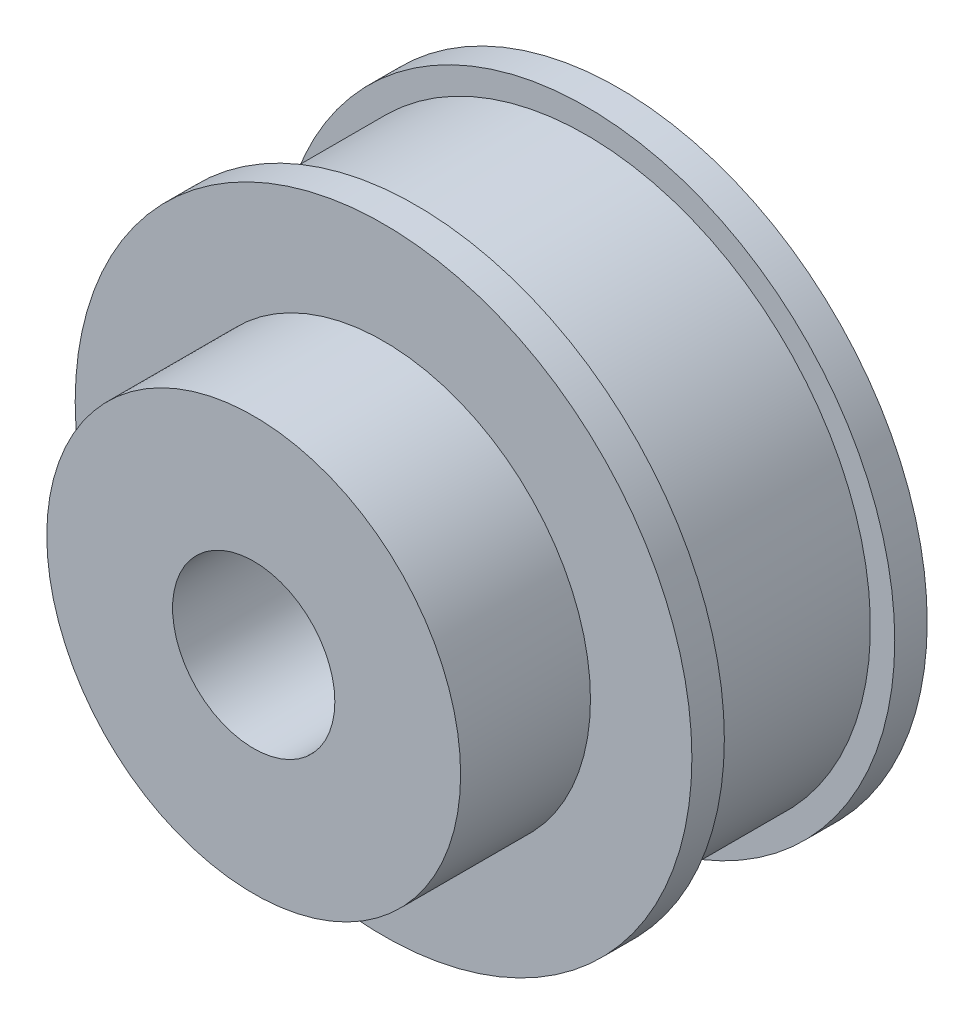
ISO-10303-21;
HEADER;
FILE_DESCRIPTION(('STEP AP214'),'2;1');
FILE_NAME('part.step','',(''),(''),'','','');
FILE_SCHEMA(('AUTOMOTIVE_DESIGN { 1 0 10303 214 1 1 1 1 }'));
ENDSEC;
DATA;
#1=APPLICATION_CONTEXT('core data for automotive mechanical design processes');
#2=APPLICATION_PROTOCOL_DEFINITION('international standard','automotive_design',2000,#1);
#3=PRODUCT_CONTEXT('',#1,'mechanical');
#4=PRODUCT('Part','Part','',(#3));
#5=PRODUCT_RELATED_PRODUCT_CATEGORY('part','',(#4));
#6=PRODUCT_DEFINITION_FORMATION('','',#4);
#7=PRODUCT_DEFINITION_CONTEXT('part definition',#1,'design');
#8=PRODUCT_DEFINITION('design','',#6,#7);
#9=PRODUCT_DEFINITION_SHAPE('','',#8);
#10=(LENGTH_UNIT() NAMED_UNIT(*) SI_UNIT(.MILLI.,.METRE.));
#11=(NAMED_UNIT(*) PLANE_ANGLE_UNIT() SI_UNIT($,.RADIAN.));
#12=(NAMED_UNIT(*) SI_UNIT($,.STERADIAN.) SOLID_ANGLE_UNIT());
#13=UNCERTAINTY_MEASURE_WITH_UNIT(LENGTH_MEASURE(1.E-05),#10,'distance_accuracy_value','');
#14=(GEOMETRIC_REPRESENTATION_CONTEXT(3) GLOBAL_UNCERTAINTY_ASSIGNED_CONTEXT((#13)) GLOBAL_UNIT_ASSIGNED_CONTEXT((#10,
#11,#12)) REPRESENTATION_CONTEXT('',''));
#15=CARTESIAN_POINT('',(0.,0.,0.));
#16=DIRECTION('',(0.,0.,1.));
#17=DIRECTION('',(1.,0.,0.));
#18=AXIS2_PLACEMENT_3D('',#15,#16,#17);
#19=CARTESIAN_POINT('',(0.,0.,14.5));
#20=DIRECTION('',(0.,0.,-1.));
#21=DIRECTION('',(-1.,0.,0.));
#22=AXIS2_PLACEMENT_3D('',#19,#20,#21);
#23=CYLINDRICAL_SURFACE('',#22,17.5);
#24=CARTESIAN_POINT('',(0.,0.,12.5));
#25=DIRECTION('',(0.,0.,-1.));
#26=DIRECTION('',(-1.,0.,0.));
#27=AXIS2_PLACEMENT_3D('',#24,#25,#26);
#28=CIRCLE('',#27,17.5);
#29=CARTESIAN_POINT('',(-17.5,0.,12.5));
#30=VERTEX_POINT('',#29);
#31=EDGE_CURVE('E63',#30,#30,#28,.T.);
#32=ORIENTED_EDGE('',*,*,#31,.T.);
#33=EDGE_LOOP('',(#32));
#34=FACE_BOUND('',#33,.T.);
#35=CARTESIAN_POINT('',(0.,0.,2.));
#36=DIRECTION('',(0.,0.,-1.));
#37=DIRECTION('',(-1.,0.,0.));
#38=AXIS2_PLACEMENT_3D('',#35,#36,#37);
#39=CIRCLE('',#38,17.5);
#40=CARTESIAN_POINT('',(-17.5,0.,2.));
#41=VERTEX_POINT('',#40);
#42=EDGE_CURVE('E10',#41,#41,#39,.T.);
#43=ORIENTED_EDGE('',*,*,#42,.F.);
#44=EDGE_LOOP('',(#43));
#45=FACE_BOUND('',#44,.T.);
#46=ADVANCED_FACE('F31',(#34,#45),#23,.T.);
#47=CARTESIAN_POINT('',(0.,0.,14.5));
#48=DIRECTION('',(0.,0.,1.));
#49=DIRECTION('',(1.,0.,0.));
#50=AXIS2_PLACEMENT_3D('',#47,#48,#49);
#51=PLANE('',#50);
#52=CARTESIAN_POINT('',(0.,0.,14.5));
#53=DIRECTION('',(0.,0.,1.));
#54=DIRECTION('',(1.,0.,0.));
#55=AXIS2_PLACEMENT_3D('',#52,#53,#54);
#56=CIRCLE('',#55,12.75);
#57=CARTESIAN_POINT('',(12.75,0.,14.5));
#58=VERTEX_POINT('',#57);
#59=EDGE_CURVE('E45',#58,#58,#56,.T.);
#60=ORIENTED_EDGE('',*,*,#59,.F.);
#61=EDGE_LOOP('',(#60));
#62=FACE_BOUND('',#61,.T.);
#63=CARTESIAN_POINT('',(0.,0.,14.5));
#64=DIRECTION('',(0.,0.,-1.));
#65=DIRECTION('',(-1.,0.,0.));
#66=AXIS2_PLACEMENT_3D('',#63,#64,#65);
#67=CIRCLE('',#66,19.);
#68=CARTESIAN_POINT('',(-19.,0.,14.5));
#69=VERTEX_POINT('',#68);
#70=EDGE_CURVE('E60',#69,#69,#67,.T.);
#71=ORIENTED_EDGE('',*,*,#70,.F.);
#72=EDGE_LOOP('',(#71));
#73=FACE_BOUND('',#72,.T.);
#74=ADVANCED_FACE('F86',(#62,#73),#51,.T.);
#75=CARTESIAN_POINT('',(0.,0.,0.));
#76=DIRECTION('',(0.,0.,1.));
#77=DIRECTION('',(1.,0.,0.));
#78=AXIS2_PLACEMENT_3D('',#75,#76,#77);
#79=PLANE('',#78);
#80=CARTESIAN_POINT('',(0.,0.,0.));
#81=DIRECTION('',(0.,0.,1.));
#82=DIRECTION('',(1.,0.,0.));
#83=AXIS2_PLACEMENT_3D('',#80,#81,#82);
#84=CIRCLE('',#83,5.);
#85=CARTESIAN_POINT('',(5.,0.,0.));
#86=VERTEX_POINT('',#85);
#87=EDGE_CURVE('E37',#86,#86,#84,.T.);
#88=ORIENTED_EDGE('',*,*,#87,.T.);
#89=EDGE_LOOP('',(#88));
#90=FACE_BOUND('',#89,.T.);
#91=CARTESIAN_POINT('',(0.,0.,0.));
#92=DIRECTION('',(0.,0.,-1.));
#93=DIRECTION('',(-1.,0.,0.));
#94=AXIS2_PLACEMENT_3D('',#91,#92,#93);
#95=CIRCLE('',#94,19.);
#96=CARTESIAN_POINT('',(-19.,0.,0.));
#97=VERTEX_POINT('',#96);
#98=EDGE_CURVE('E54',#97,#97,#95,.T.);
#99=ORIENTED_EDGE('',*,*,#98,.T.);
#100=EDGE_LOOP('',(#99));
#101=FACE_BOUND('',#100,.T.);
#102=ADVANCED_FACE('F90',(#90,#101),#79,.F.);
#103=CARTESIAN_POINT('',(0.,0.,14.5));
#104=DIRECTION('',(0.,0.,-1.));
#105=DIRECTION('',(-1.,0.,0.));
#106=AXIS2_PLACEMENT_3D('',#103,#104,#105);
#107=CYLINDRICAL_SURFACE('',#106,5.);
#108=ORIENTED_EDGE('',*,*,#87,.F.);
#109=EDGE_LOOP('',(#108));
#110=FACE_BOUND('',#109,.T.);
#111=CARTESIAN_POINT('',(0.,0.,22.5));
#112=DIRECTION('',(0.,0.,1.));
#113=DIRECTION('',(1.,0.,0.));
#114=AXIS2_PLACEMENT_3D('',#111,#112,#113);
#115=CIRCLE('',#114,5.);
#116=CARTESIAN_POINT('',(5.,0.,22.5));
#117=VERTEX_POINT('',#116);
#118=EDGE_CURVE('E49',#117,#117,#115,.T.);
#119=ORIENTED_EDGE('',*,*,#118,.T.);
#120=EDGE_LOOP('',(#119));
#121=FACE_BOUND('',#120,.T.);
#122=ADVANCED_FACE('F96',(#110,#121),#107,.F.);
#123=CARTESIAN_POINT('',(0.,0.,22.5));
#124=DIRECTION('',(0.,0.,1.));
#125=DIRECTION('',(1.,0.,0.));
#126=AXIS2_PLACEMENT_3D('',#123,#124,#125);
#127=PLANE('',#126);
#128=CARTESIAN_POINT('',(0.,0.,22.5));
#129=DIRECTION('',(0.,0.,1.));
#130=DIRECTION('',(1.,0.,0.));
#131=AXIS2_PLACEMENT_3D('',#128,#129,#130);
#132=CIRCLE('',#131,12.75);
#133=CARTESIAN_POINT('',(12.75,0.,22.5));
#134=VERTEX_POINT('',#133);
#135=EDGE_CURVE('E41',#134,#134,#132,.T.);
#136=ORIENTED_EDGE('',*,*,#135,.T.);
#137=EDGE_LOOP('',(#136));
#138=FACE_BOUND('',#137,.T.);
#139=ORIENTED_EDGE('',*,*,#118,.F.);
#140=EDGE_LOOP('',(#139));
#141=FACE_BOUND('',#140,.T.);
#142=ADVANCED_FACE('F102',(#138,#141),#127,.T.);
#143=CARTESIAN_POINT('',(0.,0.,22.5));
#144=DIRECTION('',(0.,0.,-1.));
#145=DIRECTION('',(-1.,0.,0.));
#146=AXIS2_PLACEMENT_3D('',#143,#144,#145);
#147=CYLINDRICAL_SURFACE('',#146,12.75);
#148=ORIENTED_EDGE('',*,*,#135,.F.);
#149=EDGE_LOOP('',(#148));
#150=FACE_BOUND('',#149,.T.);
#151=ORIENTED_EDGE('',*,*,#59,.T.);
#152=EDGE_LOOP('',(#151));
#153=FACE_BOUND('',#152,.T.);
#154=ADVANCED_FACE('F104',(#150,#153),#147,.T.);
#155=CARTESIAN_POINT('',(0.,0.,2.));
#156=DIRECTION('',(0.,0.,-1.));
#157=DIRECTION('',(-1.,0.,0.));
#158=AXIS2_PLACEMENT_3D('',#155,#156,#157);
#159=CYLINDRICAL_SURFACE('',#158,19.);
#160=CARTESIAN_POINT('',(0.,0.,2.));
#161=DIRECTION('',(0.,0.,-1.));
#162=DIRECTION('',(-1.,0.,0.));
#163=AXIS2_PLACEMENT_3D('',#160,#161,#162);
#164=CIRCLE('',#163,19.);
#165=CARTESIAN_POINT('',(-19.,0.,2.));
#166=VERTEX_POINT('',#165);
#167=EDGE_CURVE('E53',#166,#166,#164,.T.);
#168=ORIENTED_EDGE('',*,*,#167,.T.);
#169=EDGE_LOOP('',(#168));
#170=FACE_BOUND('',#169,.T.);
#171=ORIENTED_EDGE('',*,*,#98,.F.);
#172=EDGE_LOOP('',(#171));
#173=FACE_BOUND('',#172,.T.);
#174=ADVANCED_FACE('F83',(#170,#173),#159,.T.);
#175=CARTESIAN_POINT('',(0.,0.,2.));
#176=DIRECTION('',(0.,0.,-1.));
#177=DIRECTION('',(-1.,0.,0.));
#178=AXIS2_PLACEMENT_3D('',#175,#176,#177);
#179=PLANE('',#178);
#180=ORIENTED_EDGE('',*,*,#42,.T.);
#181=EDGE_LOOP('',(#180));
#182=FACE_BOUND('',#181,.T.);
#183=ORIENTED_EDGE('',*,*,#167,.F.);
#184=EDGE_LOOP('',(#183));
#185=FACE_BOUND('',#184,.T.);
#186=ADVANCED_FACE('F74',(#182,#185),#179,.F.);
#187=CARTESIAN_POINT('',(0.,0.,12.5));
#188=DIRECTION('',(0.,0.,-1.));
#189=DIRECTION('',(-1.,0.,0.));
#190=AXIS2_PLACEMENT_3D('',#187,#188,#189);
#191=PLANE('',#190);
#192=CARTESIAN_POINT('',(0.,0.,12.5));
#193=DIRECTION('',(0.,0.,-1.));
#194=DIRECTION('',(-1.,0.,0.));
#195=AXIS2_PLACEMENT_3D('',#192,#193,#194);
#196=CIRCLE('',#195,19.);
#197=CARTESIAN_POINT('',(-19.,0.,12.5));
#198=VERTEX_POINT('',#197);
#199=EDGE_CURVE('E57',#198,#198,#196,.T.);
#200=ORIENTED_EDGE('',*,*,#199,.T.);
#201=EDGE_LOOP('',(#200));
#202=FACE_BOUND('',#201,.T.);
#203=ORIENTED_EDGE('',*,*,#31,.F.);
#204=EDGE_LOOP('',(#203));
#205=FACE_BOUND('',#204,.T.);
#206=ADVANCED_FACE('F71',(#202,#205),#191,.T.);
#207=CARTESIAN_POINT('',(0.,0.,12.5));
#208=DIRECTION('',(0.,0.,1.));
#209=DIRECTION('',(1.,0.,0.));
#210=AXIS2_PLACEMENT_3D('',#207,#208,#209);
#211=CYLINDRICAL_SURFACE('',#210,19.);
#212=ORIENTED_EDGE('',*,*,#199,.F.);
#213=EDGE_LOOP('',(#212));
#214=FACE_BOUND('',#213,.T.);
#215=ORIENTED_EDGE('',*,*,#70,.T.);
#216=EDGE_LOOP('',(#215));
#217=FACE_BOUND('',#216,.T.);
#218=ADVANCED_FACE('F73',(#214,#217),#211,.T.);
#219=CLOSED_SHELL('',(#46,#74,#102,#122,#142,#154,#174,#186,#206,#218));
#220=MANIFOLD_SOLID_BREP('B2',#219);
#221=ADVANCED_BREP_SHAPE_REPRESENTATION('',(#18,#220),#14);
#222=SHAPE_DEFINITION_REPRESENTATION(#9,#221);
ENDSEC;
END-ISO-10303-21;
